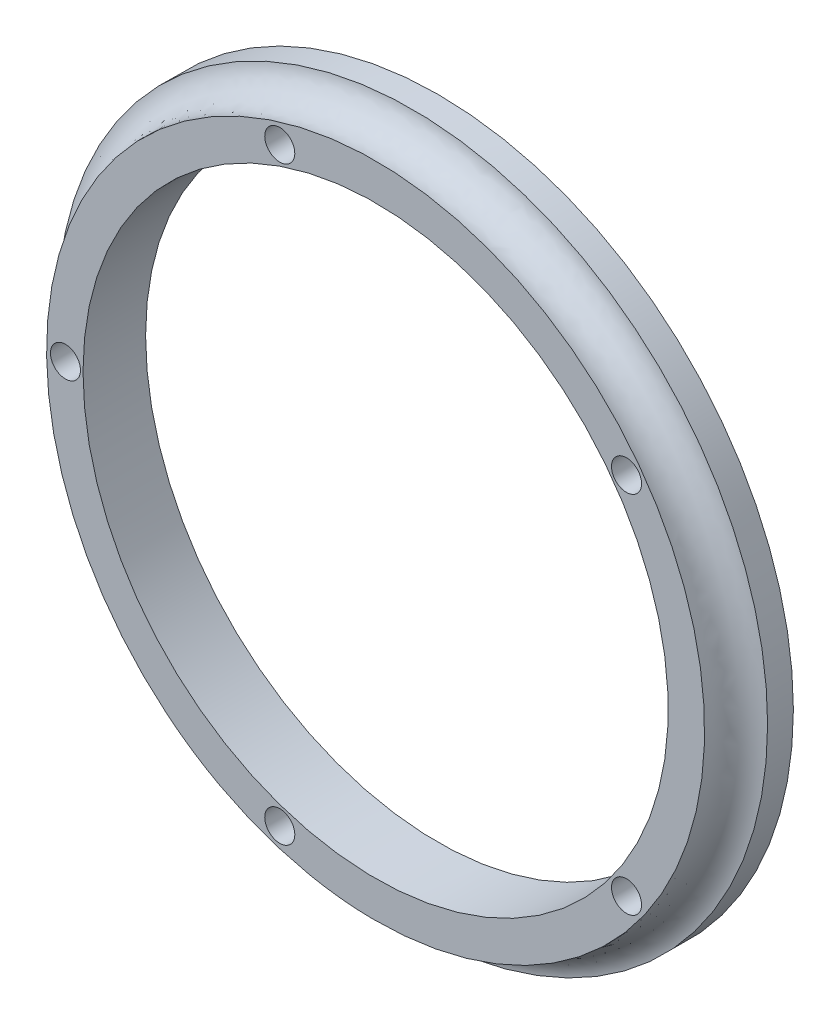
ISO-10303-21;
HEADER;
FILE_DESCRIPTION(('STEP AP214'),'2;1');
FILE_NAME('part.step','',(''),(''),'','','');
FILE_SCHEMA(('AUTOMOTIVE_DESIGN { 1 0 10303 214 1 1 1 1 }'));
ENDSEC;
DATA;
#1=APPLICATION_CONTEXT('core data for automotive mechanical design processes');
#2=APPLICATION_PROTOCOL_DEFINITION('international standard','automotive_design',2000,#1);
#3=PRODUCT_CONTEXT('',#1,'mechanical');
#4=PRODUCT('Part','Part','',(#3));
#5=PRODUCT_RELATED_PRODUCT_CATEGORY('part','',(#4));
#6=PRODUCT_DEFINITION_FORMATION('','',#4);
#7=PRODUCT_DEFINITION_CONTEXT('part definition',#1,'design');
#8=PRODUCT_DEFINITION('design','',#6,#7);
#9=PRODUCT_DEFINITION_SHAPE('','',#8);
#10=(LENGTH_UNIT() NAMED_UNIT(*) SI_UNIT(.MILLI.,.METRE.));
#11=(NAMED_UNIT(*) PLANE_ANGLE_UNIT() SI_UNIT($,.RADIAN.));
#12=(NAMED_UNIT(*) SI_UNIT($,.STERADIAN.) SOLID_ANGLE_UNIT());
#13=UNCERTAINTY_MEASURE_WITH_UNIT(LENGTH_MEASURE(1.E-05),#10,'distance_accuracy_value','');
#14=(GEOMETRIC_REPRESENTATION_CONTEXT(3) GLOBAL_UNCERTAINTY_ASSIGNED_CONTEXT((#13)) GLOBAL_UNIT_ASSIGNED_CONTEXT((#10,
#11,#12)) REPRESENTATION_CONTEXT('',''));
#15=CARTESIAN_POINT('',(0.,0.,0.));
#16=DIRECTION('',(0.,0.,1.));
#17=DIRECTION('',(1.,0.,0.));
#18=AXIS2_PLACEMENT_3D('',#15,#16,#17);
#19=CARTESIAN_POINT('',(22.4193274999239,0.,74.6018381280821));
#20=DIRECTION('',(-3.2251458448318E-12,0.,-1.));
#21=DIRECTION('',(-1.,0.,3.2251458448318E-12));
#22=AXIS2_PLACEMENT_3D('',#19,#20,#21);
#23=PLANE('',#22);
#24=CARTESIAN_POINT('',(11.209663749967,57.3172158216385,74.6018381281182));
#25=DIRECTION('',(-3.2251458448318E-12,0.,-1.));
#26=DIRECTION('',(-1.,0.,3.2251458448318E-12));
#27=AXIS2_PLACEMENT_3D('',#24,#25,#26);
#28=CIRCLE('',#27,29.2163369894019);
#29=CARTESIAN_POINT('',(-18.0066732394349,57.3172158216385,74.6018381282125));
#30=VERTEX_POINT('',#29);
#31=EDGE_CURVE('E12',#30,#30,#28,.T.);
#32=ORIENTED_EDGE('',*,*,#31,.T.);
#33=EDGE_LOOP('',(#32));
#34=FACE_BOUND('',#33,.T.);
#35=CARTESIAN_POINT('',(1.64053936670039,86.7679524012009,74.6018381281491));
#36=DIRECTION('',(-3.2251458448318E-12,0.,-1.));
#37=DIRECTION('',(-1.,0.,3.2251458448318E-12));
#38=AXIS2_PLACEMENT_3D('',#35,#36,#37);
#39=CIRCLE('',#38,1.5);
#40=CARTESIAN_POINT('',(0.140539366700388,86.7679524012009,74.6018381281539));
#41=VERTEX_POINT('',#40);
#42=EDGE_CURVE('E90',#41,#41,#39,.F.);
#43=ORIENTED_EDGE('',*,*,#42,.F.);
#44=EDGE_LOOP('',(#43));
#45=FACE_BOUND('',#44,.T.);
#46=CARTESIAN_POINT('',(36.2619566279346,39.115659621749,74.6018381280374));
#47=DIRECTION('',(-3.2251458448318E-12,0.,-1.));
#48=DIRECTION('',(-1.,0.,3.2251458448318E-12));
#49=AXIS2_PLACEMENT_3D('',#46,#47,#48);
#50=CIRCLE('',#49,1.5);
#51=CARTESIAN_POINT('',(34.7619566279346,39.115659621749,74.6018381280423));
#52=VERTEX_POINT('',#51);
#53=EDGE_CURVE('E84',#52,#52,#50,.F.);
#54=ORIENTED_EDGE('',*,*,#53,.F.);
#55=EDGE_LOOP('',(#54));
#56=FACE_BOUND('',#55,.T.);
#57=CARTESIAN_POINT('',(11.209663749967,57.3172158216385,74.6018381281182));
#58=DIRECTION('',(3.2251458448318E-12,0.,1.));
#59=DIRECTION('',(1.,0.,-3.2251458448318E-12));
#60=AXIS2_PLACEMENT_3D('',#57,#58,#59);
#61=CIRCLE('',#60,32.8540791111458);
#62=CARTESIAN_POINT('',(22.4193274999239,88.1997991471042,74.6018381280821));
#63=VERTEX_POINT('',#62);
#64=EDGE_CURVE('E50',#63,#63,#61,.F.);
#65=ORIENTED_EDGE('',*,*,#64,.F.);
#66=EDGE_LOOP('',(#65));
#67=FACE_BOUND('',#66,.T.);
#68=CARTESIAN_POINT('',(36.2619566279348,75.5187720215277,74.6018381280374));
#69=DIRECTION('',(-3.2251458448318E-12,0.,-1.));
#70=DIRECTION('',(-1.,0.,3.2251458448318E-12));
#71=AXIS2_PLACEMENT_3D('',#68,#69,#70);
#72=CIRCLE('',#71,1.5);
#73=CARTESIAN_POINT('',(34.7619566279348,75.5187720215277,74.6018381280423));
#74=VERTEX_POINT('',#73);
#75=EDGE_CURVE('E81',#74,#74,#72,.F.);
#76=ORIENTED_EDGE('',*,*,#75,.F.);
#77=EDGE_LOOP('',(#76));
#78=FACE_BOUND('',#77,.T.);
#79=CARTESIAN_POINT('',(1.64053936669998,27.8664792420763,74.6018381281491));
#80=DIRECTION('',(-3.2251458448318E-12,0.,-1.));
#81=DIRECTION('',(-1.,0.,3.2251458448318E-12));
#82=AXIS2_PLACEMENT_3D('',#79,#80,#81);
#83=CIRCLE('',#82,1.5);
#84=CARTESIAN_POINT('',(0.140539366699972,27.8664792420763,74.6018381281539));
#85=VERTEX_POINT('',#84);
#86=EDGE_CURVE('E87',#85,#85,#83,.F.);
#87=ORIENTED_EDGE('',*,*,#86,.F.);
#88=EDGE_LOOP('',(#87));
#89=FACE_BOUND('',#88,.T.);
#90=CARTESIAN_POINT('',(-19.7566732394349,57.3172158216385,74.6018381282181));
#91=DIRECTION('',(-3.2251458448318E-12,0.,-1.));
#92=DIRECTION('',(-1.,0.,3.2251458448318E-12));
#93=AXIS2_PLACEMENT_3D('',#90,#91,#92);
#94=CIRCLE('',#93,1.5);
#95=CARTESIAN_POINT('',(-21.2566732394349,57.3172158216385,74.601838128223));
#96=VERTEX_POINT('',#95);
#97=EDGE_CURVE('E43',#96,#96,#94,.F.);
#98=ORIENTED_EDGE('',*,*,#97,.F.);
#99=EDGE_LOOP('',(#98));
#100=FACE_BOUND('',#99,.T.);
#101=ADVANCED_FACE('F36',(#34,#45,#56,#67,#78,#89,#100),#23,.F.);
#102=CARTESIAN_POINT('',(11.2096637499469,57.3172158216385,68.3518381281182));
#103=DIRECTION('',(3.2251458448318E-12,0.,1.));
#104=DIRECTION('',(1.,0.,-3.2251458448318E-12));
#105=AXIS2_PLACEMENT_3D('',#102,#103,#104);
#106=PLANE('',#105);
#107=CARTESIAN_POINT('',(36.2619566279147,75.5187720215277,68.3518381280374));
#108=DIRECTION('',(3.2251458448318E-12,0.,1.));
#109=DIRECTION('',(-0.809016994374951,-0.587785252292469,2.60919779780668E-12));
#110=AXIS2_PLACEMENT_3D('',#107,#108,#109);
#111=CIRCLE('',#110,1.5);
#112=CARTESIAN_POINT('',(35.0484311363523,74.637094143089,68.3518381280414));
#113=VERTEX_POINT('',#112);
#114=EDGE_CURVE('E62',#113,#113,#111,.T.);
#115=ORIENTED_EDGE('',*,*,#114,.T.);
#116=EDGE_LOOP('',(#115));
#117=FACE_BOUND('',#116,.T.);
#118=CARTESIAN_POINT('',(36.2619566279144,39.115659621749,68.3518381280374));
#119=DIRECTION('',(3.2251458448318E-12,0.,1.));
#120=DIRECTION('',(-0.809016994374942,0.58778525229248,2.60919779780666E-12));
#121=AXIS2_PLACEMENT_3D('',#118,#119,#120);
#122=CIRCLE('',#121,1.5);
#123=CARTESIAN_POINT('',(35.048431136352,39.9973375001877,68.3518381280414));
#124=VERTEX_POINT('',#123);
#125=EDGE_CURVE('E59',#124,#124,#122,.T.);
#126=ORIENTED_EDGE('',*,*,#125,.T.);
#127=EDGE_LOOP('',(#126));
#128=FACE_BOUND('',#127,.T.);
#129=CARTESIAN_POINT('',(1.64053936667982,27.8664792420763,68.3518381281491));
#130=DIRECTION('',(3.2251458448318E-12,0.,1.));
#131=DIRECTION('',(0.309016994374958,0.95105651629515,-9.96624875390808E-13));
#132=AXIS2_PLACEMENT_3D('',#129,#130,#131);
#133=CIRCLE('',#132,1.5);
#134=CARTESIAN_POINT('',(2.10406485824226,29.293064016519,68.3518381281476));
#135=VERTEX_POINT('',#134);
#136=EDGE_CURVE('E56',#135,#135,#133,.T.);
#137=ORIENTED_EDGE('',*,*,#136,.T.);
#138=EDGE_LOOP('',(#137));
#139=FACE_BOUND('',#138,.T.);
#140=CARTESIAN_POINT('',(1.64053936668023,86.7679524012009,68.3518381281491));
#141=DIRECTION('',(3.2251458448318E-12,0.,1.));
#142=DIRECTION('',(0.309016994374945,-0.951056516295155,-9.96624875390765E-13));
#143=AXIS2_PLACEMENT_3D('',#140,#141,#142);
#144=CIRCLE('',#143,1.5);
#145=CARTESIAN_POINT('',(2.10406485824265,85.3413676267581,68.3518381281476));
#146=VERTEX_POINT('',#145);
#147=EDGE_CURVE('E65',#146,#146,#144,.T.);
#148=ORIENTED_EDGE('',*,*,#147,.T.);
#149=EDGE_LOOP('',(#148));
#150=FACE_BOUND('',#149,.T.);
#151=CARTESIAN_POINT('',(-19.756673239455,57.3172158216385,68.3518381282181));
#152=DIRECTION('',(3.2251458448318E-12,0.,1.));
#153=DIRECTION('',(1.,0.,-3.2251458448318E-12));
#154=AXIS2_PLACEMENT_3D('',#151,#152,#153);
#155=CIRCLE('',#154,1.5);
#156=CARTESIAN_POINT('',(-18.256673239455,57.3172158216385,68.3518381282133));
#157=VERTEX_POINT('',#156);
#158=EDGE_CURVE('E70',#157,#157,#155,.T.);
#159=ORIENTED_EDGE('',*,*,#158,.T.);
#160=EDGE_LOOP('',(#159));
#161=FACE_BOUND('',#160,.T.);
#162=CARTESIAN_POINT('',(11.2096637499469,57.3172158216385,68.3518381281182));
#163=DIRECTION('',(3.2251458448318E-12,0.,1.));
#164=DIRECTION('',(1.,0.,-3.2251458448318E-12));
#165=AXIS2_PLACEMENT_3D('',#162,#163,#164);
#166=CIRCLE('',#165,29.2163369894019);
#167=CARTESIAN_POINT('',(40.4260007393488,57.3172158216385,68.351838128024));
#168=VERTEX_POINT('',#167);
#169=EDGE_CURVE('E73',#168,#168,#166,.T.);
#170=ORIENTED_EDGE('',*,*,#169,.T.);
#171=EDGE_LOOP('',(#170));
#172=FACE_BOUND('',#171,.T.);
#173=CARTESIAN_POINT('',(11.2096637499469,57.3172158216385,68.3518381281182));
#174=DIRECTION('',(3.2251458448318E-12,0.,1.));
#175=DIRECTION('',(1.,0.,-3.2251458448318E-12));
#176=AXIS2_PLACEMENT_3D('',#173,#174,#175);
#177=CIRCLE('',#176,35.4663369894019);
#178=CARTESIAN_POINT('',(46.6760007393488,57.3172158216385,68.3518381280039));
#179=VERTEX_POINT('',#178);
#180=EDGE_CURVE('E76',#179,#179,#177,.T.);
#181=ORIENTED_EDGE('',*,*,#180,.F.);
#182=EDGE_LOOP('',(#181));
#183=FACE_BOUND('',#182,.T.);
#184=ADVANCED_FACE('F99',(#117,#128,#139,#150,#161,#172,#183),#106,.F.);
#185=CARTESIAN_POINT('',(36.2619566279147,75.5187720215277,68.3518381280374));
#186=DIRECTION('',(3.2251458448318E-12,0.,1.));
#187=DIRECTION('',(1.,0.,-3.2251458448318E-12));
#188=AXIS2_PLACEMENT_3D('',#185,#186,#187);
#189=CYLINDRICAL_SURFACE('',#188,1.5);
#190=ORIENTED_EDGE('',*,*,#75,.T.);
#191=EDGE_LOOP('',(#190));
#192=FACE_BOUND('',#191,.T.);
#193=ORIENTED_EDGE('',*,*,#114,.F.);
#194=EDGE_LOOP('',(#193));
#195=FACE_BOUND('',#194,.T.);
#196=ADVANCED_FACE('F104',(#192,#195),#189,.F.);
#197=CARTESIAN_POINT('',(36.2619566279144,39.115659621749,68.3518381280374));
#198=DIRECTION('',(3.2251458448318E-12,0.,1.));
#199=DIRECTION('',(1.,0.,-3.2251458448318E-12));
#200=AXIS2_PLACEMENT_3D('',#197,#198,#199);
#201=CYLINDRICAL_SURFACE('',#200,1.5);
#202=ORIENTED_EDGE('',*,*,#53,.T.);
#203=EDGE_LOOP('',(#202));
#204=FACE_BOUND('',#203,.T.);
#205=ORIENTED_EDGE('',*,*,#125,.F.);
#206=EDGE_LOOP('',(#205));
#207=FACE_BOUND('',#206,.T.);
#208=ADVANCED_FACE('F126',(#204,#207),#201,.F.);
#209=CARTESIAN_POINT('',(1.64053936667982,27.8664792420763,68.3518381281491));
#210=DIRECTION('',(3.2251458448318E-12,0.,1.));
#211=DIRECTION('',(1.,0.,-3.2251458448318E-12));
#212=AXIS2_PLACEMENT_3D('',#209,#210,#211);
#213=CYLINDRICAL_SURFACE('',#212,1.5);
#214=ORIENTED_EDGE('',*,*,#86,.T.);
#215=EDGE_LOOP('',(#214));
#216=FACE_BOUND('',#215,.T.);
#217=ORIENTED_EDGE('',*,*,#136,.F.);
#218=EDGE_LOOP('',(#217));
#219=FACE_BOUND('',#218,.T.);
#220=ADVANCED_FACE('F130',(#216,#219),#213,.F.);
#221=CARTESIAN_POINT('',(1.64053936668023,86.7679524012009,68.3518381281491));
#222=DIRECTION('',(3.2251458448318E-12,0.,1.));
#223=DIRECTION('',(1.,0.,-3.2251458448318E-12));
#224=AXIS2_PLACEMENT_3D('',#221,#222,#223);
#225=CYLINDRICAL_SURFACE('',#224,1.5);
#226=ORIENTED_EDGE('',*,*,#42,.T.);
#227=EDGE_LOOP('',(#226));
#228=FACE_BOUND('',#227,.T.);
#229=ORIENTED_EDGE('',*,*,#147,.F.);
#230=EDGE_LOOP('',(#229));
#231=FACE_BOUND('',#230,.T.);
#232=ADVANCED_FACE('F134',(#228,#231),#225,.F.);
#233=CARTESIAN_POINT('',(-19.756673239455,57.3172158216385,68.3518381282181));
#234=DIRECTION('',(3.2251458448318E-12,0.,1.));
#235=DIRECTION('',(1.,0.,-3.2251458448318E-12));
#236=AXIS2_PLACEMENT_3D('',#233,#234,#235);
#237=CYLINDRICAL_SURFACE('',#236,1.5);
#238=ORIENTED_EDGE('',*,*,#97,.T.);
#239=EDGE_LOOP('',(#238));
#240=FACE_BOUND('',#239,.T.);
#241=ORIENTED_EDGE('',*,*,#158,.F.);
#242=EDGE_LOOP('',(#241));
#243=FACE_BOUND('',#242,.T.);
#244=ADVANCED_FACE('F95',(#240,#243),#237,.F.);
#245=CARTESIAN_POINT('',(11.2096637502537,57.3172158216385,163.488118154668));
#246=DIRECTION('',(-3.2251458448318E-12,0.,-1.));
#247=DIRECTION('',(-1.,0.,3.2251458448318E-12));
#248=AXIS2_PLACEMENT_3D('',#245,#246,#247);
#249=CYLINDRICAL_SURFACE('',#248,29.2163369894019);
#250=ORIENTED_EDGE('',*,*,#31,.F.);
#251=EDGE_LOOP('',(#250));
#252=FACE_BOUND('',#251,.T.);
#253=ORIENTED_EDGE('',*,*,#169,.F.);
#254=EDGE_LOOP('',(#253));
#255=FACE_BOUND('',#254,.T.);
#256=ADVANCED_FACE('F114',(#252,#255),#249,.F.);
#257=CARTESIAN_POINT('',(11.2096637499469,57.3172158216385,68.3518381281182));
#258=DIRECTION('',(3.2251458448318E-12,0.,1.));
#259=DIRECTION('',(1.,0.,-3.2251458448318E-12));
#260=AXIS2_PLACEMENT_3D('',#257,#258,#259);
#261=CYLINDRICAL_SURFACE('',#260,35.4663369894019);
#262=CARTESIAN_POINT('',(11.2096637499552,57.3172158216385,70.9263147016042));
#263=DIRECTION('',(3.2251458448318E-12,0.,1.));
#264=DIRECTION('',(1.,0.,-3.2251458448318E-12));
#265=AXIS2_PLACEMENT_3D('',#262,#263,#264);
#266=CIRCLE('',#265,35.4663369894019);
#267=CARTESIAN_POINT('',(22.4193274999121,90.965462403871,70.926314701568));
#268=VERTEX_POINT('',#267);
#269=EDGE_CURVE('E55',#268,#268,#266,.T.);
#270=ORIENTED_EDGE('',*,*,#269,.F.);
#271=EDGE_LOOP('',(#270));
#272=FACE_BOUND('',#271,.T.);
#273=ORIENTED_EDGE('',*,*,#180,.T.);
#274=EDGE_LOOP('',(#273));
#275=FACE_BOUND('',#274,.T.);
#276=ADVANCED_FACE('F109',(#272,#275),#261,.T.);
#277=CARTESIAN_POINT('',(22.4193274999326,91.36049527296,77.3018381280821));
#278=CARTESIAN_POINT('',(-45.6672314027104,113.779822772874,77.3018381283017));
#279=CARTESIAN_POINT('',(-68.0865589026242,45.6932638702307,77.301838128374));
#280=CARTESIAN_POINT('',(1.88633830777718E-11,23.273936370317,77.3018381281544));
#281=CARTESIAN_POINT('',(68.0865589026619,0.854608870403187,77.3018381279348));
#282=CARTESIAN_POINT('',(90.5058864025757,68.9411677730463,77.3018381278625));
#283=CARTESIAN_POINT('',(22.4193274999326,91.36049527296,77.3018381280821));
#284=CARTESIAN_POINT('',(22.4193274999326,97.7604952729601,77.3018381280821));
#285=CARTESIAN_POINT('',(-58.4672314027105,120.179822772874,77.3018381283429));
#286=CARTESIAN_POINT('',(-80.8865589026243,39.2932638702307,77.3018381284153));
#287=CARTESIAN_POINT('',(1.88625157160338E-11,16.8739363703169,77.3018381281544));
#288=CARTESIAN_POINT('',(80.886558902662,-5.54539112959684,77.3018381278935));
#289=CARTESIAN_POINT('',(103.305886402576,75.3411677730463,77.3018381278212));
#290=CARTESIAN_POINT('',(22.4193274999326,97.7604952729601,77.3018381280821));
#291=CARTESIAN_POINT('',(22.419327499912,97.7604952729601,70.901838128082));
#292=CARTESIAN_POINT('',(-58.4672314027311,120.179822772874,70.9018381283429));
#293=CARTESIAN_POINT('',(-80.8865589026449,39.2932638702307,70.9018381284152));
#294=CARTESIAN_POINT('',(-1.77722420113824E-12,16.8739363703169,70.9018381281544));
#295=CARTESIAN_POINT('',(80.8865589026414,-5.54539112959684,70.9018381278935));
#296=CARTESIAN_POINT('',(103.305886402555,75.3411677730463,70.9018381278212));
#297=CARTESIAN_POINT('',(22.419327499912,97.7604952729601,70.901838128082));
#298=CARTESIAN_POINT('',(22.419327499912,91.36049527296,70.9018381280821));
#299=CARTESIAN_POINT('',(-45.6672314027311,113.779822772874,70.9018381283016));
#300=CARTESIAN_POINT('',(-68.0865589026449,45.6932638702307,70.9018381283739));
#301=CARTESIAN_POINT('',(-1.77635683940025E-12,23.273936370317,70.9018381281544));
#302=CARTESIAN_POINT('',(68.0865589026413,0.854608870403187,70.9018381279348));
#303=CARTESIAN_POINT('',(90.5058864025551,68.9411677730463,70.9018381278625));
#304=CARTESIAN_POINT('',(22.419327499912,91.36049527296,70.9018381280821));
#305=CARTESIAN_POINT('',(22.419327499912,84.96049527296,70.901838128082));
#306=CARTESIAN_POINT('',(-32.867231402731,107.379822772874,70.9018381282604));
#307=CARTESIAN_POINT('',(-55.2865589026448,52.0932638702308,70.9018381283327));
#308=CARTESIAN_POINT('',(-1.77722420113824E-12,29.673936370317,70.9018381281544));
#309=CARTESIAN_POINT('',(55.2865589026412,7.25460887040322,70.901838127976));
#310=CARTESIAN_POINT('',(77.705886402555,62.5411677730462,70.9018381279038));
#311=CARTESIAN_POINT('',(22.419327499912,84.96049527296,70.901838128082));
#312=CARTESIAN_POINT('',(22.4193274999326,84.96049527296,77.3018381280821));
#313=CARTESIAN_POINT('',(-32.8672314027104,107.379822772874,77.3018381282604));
#314=CARTESIAN_POINT('',(-55.2865589026242,52.0932638702308,77.3018381283327));
#315=CARTESIAN_POINT('',(1.88625157160338E-11,29.673936370317,77.3018381281544));
#316=CARTESIAN_POINT('',(55.2865589026619,7.25460887040322,77.3018381279761));
#317=CARTESIAN_POINT('',(77.7058864025756,62.5411677730462,77.3018381279037));
#318=CARTESIAN_POINT('',(22.4193274999326,84.96049527296,77.3018381280821));
#319=CARTESIAN_POINT('',(22.4193274999326,91.36049527296,77.3018381280821));
#320=CARTESIAN_POINT('',(-45.6672314027104,113.779822772874,77.3018381283017));
#321=CARTESIAN_POINT('',(-68.0865589026242,45.6932638702307,77.301838128374));
#322=CARTESIAN_POINT('',(1.88633830777718E-11,23.273936370317,77.3018381281544));
#323=CARTESIAN_POINT('',(68.0865589026619,0.854608870403187,77.3018381279348));
#324=CARTESIAN_POINT('',(90.5058864025757,68.9411677730463,77.3018381278625));
#325=CARTESIAN_POINT('',(22.4193274999326,91.36049527296,77.3018381280821));
#326=(BOUNDED_SURFACE() B_SPLINE_SURFACE(3,3,((#277,#278,#279,#280,#281,#282,#283),(#284,#285,
#286,#287,#288,#289,#290),(#291,#292,#293,#294,#295,#296,#297),(#298,#299,#300,#301,#302,#303,
#304),(#305,#306,#307,#308,#309,#310,#311),(#312,#313,#314,#315,#316,#317,#318),(#319,#320,#321,
#322,#323,#324,#325)),.UNSPECIFIED.,.T.,.T.,.F.) B_SPLINE_SURFACE_WITH_KNOTS((4,3,4),(4,3,4),
(0.,0.5,1.),(0.,0.5,1.),
.UNSPECIFIED.) GEOMETRIC_REPRESENTATION_ITEM() RATIONAL_B_SPLINE_SURFACE(((1.,0.333333333333333,
0.333333333333333,1.,0.333333333333333,0.333333333333333,1.),(0.333333333333333,
0.111111111111111,0.111111111111111,0.333333333333333,0.111111111111111,0.111111111111111,
0.333333333333333),(0.333333333333333,0.111111111111111,0.111111111111111,0.333333333333333,
0.111111111111111,0.111111111111111,0.333333333333333),(1.,0.333333333333333,0.333333333333333,
1.,0.333333333333333,0.333333333333333,1.),(0.333333333333333,0.111111111111111,
0.111111111111111,0.333333333333333,0.111111111111111,0.111111111111111,0.333333333333333),
(0.333333333333333,0.111111111111111,0.111111111111111,0.333333333333333,0.111111111111111,
0.111111111111111,0.333333333333333),(1.,0.333333333333333,0.333333333333333,1.,
0.333333333333333,0.333333333333333,1.))) REPRESENTATION_ITEM('') SURFACE());
#327=CARTESIAN_POINT('',(22.4193274999223,91.36049527296,74.1018381280821));
#328=DIRECTION('',(-1.,0.,3.2251458448318E-12));
#329=DIRECTION('',(3.2251458448318E-12,0.,1.));
#330=AXIS2_PLACEMENT_3D('',#327,#328,#329);
#331=CIRCLE('',#330,3.20000000000001);
#332=EDGE_CURVE('E52',#268,#63,#331,.T.);
#333=ORIENTED_EDGE('',*,*,#332,.T.);
#334=ORIENTED_EDGE('',*,*,#64,.T.);
#335=ORIENTED_EDGE('',*,*,#332,.F.);
#336=ORIENTED_EDGE('',*,*,#269,.T.);
#337=EDGE_LOOP('',(#333,#334,#335,#336));
#338=FACE_BOUND('',#337,.T.);
#339=ADVANCED_FACE('F53',(#338),#326,.F.);
#340=CLOSED_SHELL('',(#101,#184,#196,#208,#220,#232,#244,#256,#276,#339));
#341=MANIFOLD_SOLID_BREP('B2',#340);
#342=ADVANCED_BREP_SHAPE_REPRESENTATION('',(#18,#341),#14);
#343=SHAPE_DEFINITION_REPRESENTATION(#9,#342);
ENDSEC;
END-ISO-10303-21;
